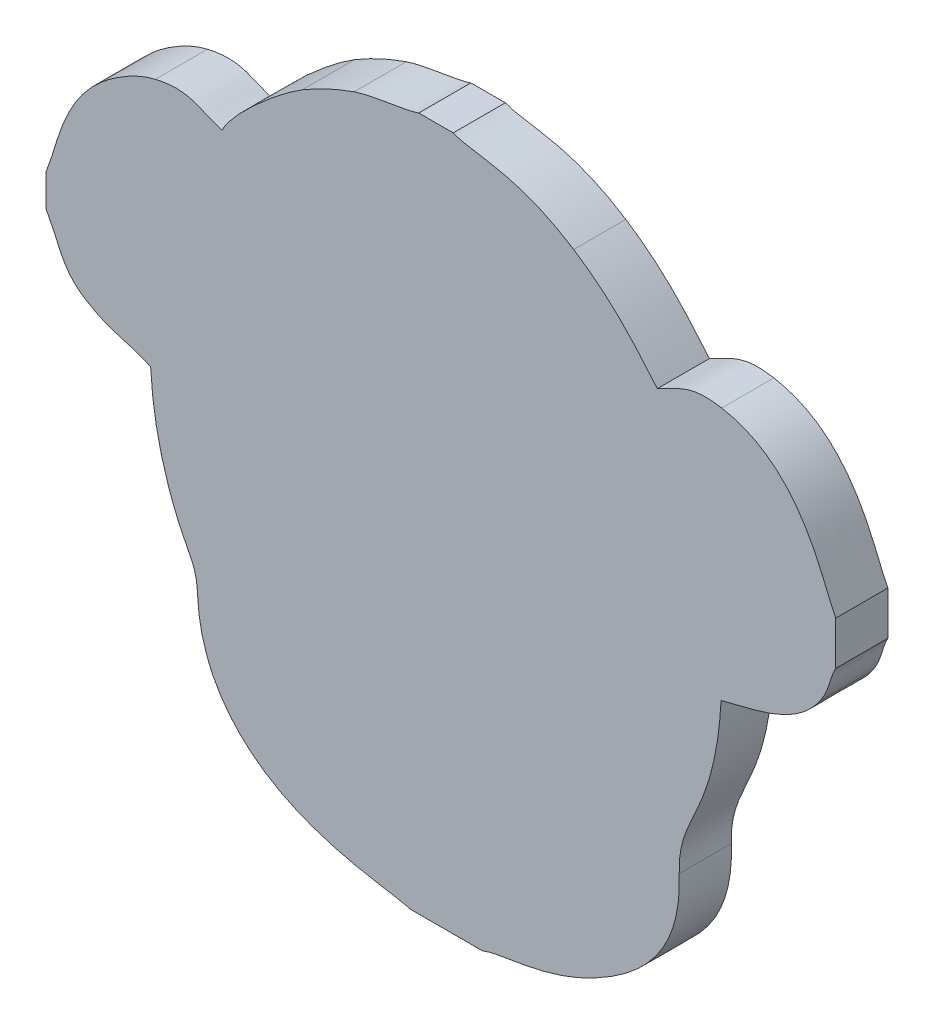
ISO-10303-21;
HEADER;
FILE_DESCRIPTION(('STEP AP214'),'2;1');
FILE_NAME('part.step','',(''),(''),'','','');
FILE_SCHEMA(('AUTOMOTIVE_DESIGN { 1 0 10303 214 1 1 1 1 }'));
ENDSEC;
DATA;
#1=APPLICATION_CONTEXT('core data for automotive mechanical design processes');
#2=APPLICATION_PROTOCOL_DEFINITION('international standard','automotive_design',2000,#1);
#3=PRODUCT_CONTEXT('',#1,'mechanical');
#4=PRODUCT('Part','Part','',(#3));
#5=PRODUCT_RELATED_PRODUCT_CATEGORY('part','',(#4));
#6=PRODUCT_DEFINITION_FORMATION('','',#4);
#7=PRODUCT_DEFINITION_CONTEXT('part definition',#1,'design');
#8=PRODUCT_DEFINITION('design','',#6,#7);
#9=PRODUCT_DEFINITION_SHAPE('','',#8);
#10=(LENGTH_UNIT() NAMED_UNIT(*) SI_UNIT(.MILLI.,.METRE.));
#11=(NAMED_UNIT(*) PLANE_ANGLE_UNIT() SI_UNIT($,.RADIAN.));
#12=(NAMED_UNIT(*) SI_UNIT($,.STERADIAN.) SOLID_ANGLE_UNIT());
#13=UNCERTAINTY_MEASURE_WITH_UNIT(LENGTH_MEASURE(1.E-05),#10,'distance_accuracy_value','');
#14=(GEOMETRIC_REPRESENTATION_CONTEXT(3) GLOBAL_UNCERTAINTY_ASSIGNED_CONTEXT((#13)) GLOBAL_UNIT_ASSIGNED_CONTEXT((#10,
#11,#12)) REPRESENTATION_CONTEXT('',''));
#15=CARTESIAN_POINT('',(0.,0.,0.));
#16=DIRECTION('',(0.,0.,1.));
#17=DIRECTION('',(1.,0.,0.));
#18=AXIS2_PLACEMENT_3D('',#15,#16,#17);
#19=CARTESIAN_POINT('',(55.1272,103.3338,3.));
#20=CARTESIAN_POINT('',(55.9357,101.875,3.));
#21=CARTESIAN_POINT('',(56.0272,100.8916,3.));
#22=CARTESIAN_POINT('',(57.2517,100.0613,3.));
#23=B_SPLINE_CURVE_WITH_KNOTS('',3,(#19,#20,#21,#22),.UNSPECIFIED.,.F.,.F.,(4,4),
(0.0384615384615385,0.0769230769230769),.UNSPECIFIED.);
#24=DIRECTION('',(0.,0.,-1.));
#25=VECTOR('',#24,1.);
#26=SURFACE_OF_LINEAR_EXTRUSION('',#23,#25);
#27=CARTESIAN_POINT('',(55.1272,103.3338,0.));
#28=CARTESIAN_POINT('',(55.9357,101.875,0.));
#29=CARTESIAN_POINT('',(56.0272,100.8916,0.));
#30=CARTESIAN_POINT('',(57.2517,100.0613,0.));
#31=B_SPLINE_CURVE_WITH_KNOTS('',3,(#27,#28,#29,#30),.UNSPECIFIED.,.F.,.F.,(4,4),
(0.0384615384615385,0.0769230769230769),.UNSPECIFIED.);
#32=CARTESIAN_POINT('',(55.1272,103.3338,0.));
#33=VERTEX_POINT('',#32);
#34=CARTESIAN_POINT('',(57.2517,100.0613,0.));
#35=VERTEX_POINT('',#34);
#36=EDGE_CURVE('E412',#33,#35,#31,.T.);
#37=ORIENTED_EDGE('',*,*,#36,.T.);
#38=DIRECTION('',(0.,0.,-1.));
#39=VECTOR('',#38,1.);
#40=CARTESIAN_POINT('',(57.2517,100.0613,3.));
#41=LINE('',#40,#39);
#42=CARTESIAN_POINT('',(57.2517,100.0613,3.));
#43=VERTEX_POINT('',#42);
#44=EDGE_CURVE('E11',#43,#35,#41,.T.);
#45=ORIENTED_EDGE('',*,*,#44,.F.);
#46=CARTESIAN_POINT('',(55.1272,103.3338,3.));
#47=VERTEX_POINT('',#46);
#48=EDGE_CURVE('E546',#47,#43,#23,.T.);
#49=ORIENTED_EDGE('',*,*,#48,.F.);
#50=DIRECTION('',(0.,0.,-1.));
#51=VECTOR('',#50,1.);
#52=CARTESIAN_POINT('',(55.1272,103.3338,3.));
#53=LINE('',#52,#51);
#54=EDGE_CURVE('E230',#47,#33,#53,.T.);
#55=ORIENTED_EDGE('',*,*,#54,.T.);
#56=EDGE_LOOP('',(#37,#45,#49,#55));
#57=FACE_BOUND('',#56,.T.);
#58=ADVANCED_FACE('F35',(#57),#26,.F.);
#59=CARTESIAN_POINT('',(57.2517,100.0613,3.));
#60=CARTESIAN_POINT('',(58.7272,99.0608,3.));
#61=CARTESIAN_POINT('',(59.7559,99.1354,3.));
#62=CARTESIAN_POINT('',(61.1406,98.4843,3.));
#63=B_SPLINE_CURVE_WITH_KNOTS('',3,(#59,#60,#61,#62),.UNSPECIFIED.,.F.,.F.,(4,4),
(0.0769230769230769,0.115384615384615),.UNSPECIFIED.);
#64=DIRECTION('',(0.,0.,-1.));
#65=VECTOR('',#64,1.);
#66=SURFACE_OF_LINEAR_EXTRUSION('',#63,#65);
#67=CARTESIAN_POINT('',(57.2517,100.0613,0.));
#68=CARTESIAN_POINT('',(58.7272,99.0608,0.));
#69=CARTESIAN_POINT('',(59.7559,99.1354,0.));
#70=CARTESIAN_POINT('',(61.1406,98.4843,0.));
#71=B_SPLINE_CURVE_WITH_KNOTS('',3,(#67,#68,#69,#70),.UNSPECIFIED.,.F.,.F.,(4,4),
(0.0769230769230769,0.115384615384615),.UNSPECIFIED.);
#72=CARTESIAN_POINT('',(61.1406,98.4843,0.));
#73=VERTEX_POINT('',#72);
#74=EDGE_CURVE('E406',#35,#73,#71,.T.);
#75=ORIENTED_EDGE('',*,*,#74,.T.);
#76=DIRECTION('',(0.,0.,-1.));
#77=VECTOR('',#76,1.);
#78=CARTESIAN_POINT('',(61.1406,98.4843,3.));
#79=LINE('',#78,#77);
#80=CARTESIAN_POINT('',(61.1406,98.4843,3.));
#81=VERTEX_POINT('',#80);
#82=EDGE_CURVE('E44',#81,#73,#79,.T.);
#83=ORIENTED_EDGE('',*,*,#82,.F.);
#84=EDGE_CURVE('E146',#43,#81,#63,.T.);
#85=ORIENTED_EDGE('',*,*,#84,.F.);
#86=ORIENTED_EDGE('',*,*,#44,.T.);
#87=EDGE_LOOP('',(#75,#83,#85,#86));
#88=FACE_BOUND('',#87,.T.);
#89=ADVANCED_FACE('F574',(#88),#66,.F.);
#90=CARTESIAN_POINT('',(61.1406,98.4843,3.));
#91=CARTESIAN_POINT('',(61.2643,95.9602,3.));
#92=CARTESIAN_POINT('',(61.838,93.6047,3.));
#93=CARTESIAN_POINT('',(62.7653,91.5083,3.));
#94=B_SPLINE_CURVE_WITH_KNOTS('',3,(#90,#91,#92,#93),.UNSPECIFIED.,.F.,.F.,(4,4),
(0.115384615384615,0.153846153846154),.UNSPECIFIED.);
#95=DIRECTION('',(0.,0.,-1.));
#96=VECTOR('',#95,1.);
#97=SURFACE_OF_LINEAR_EXTRUSION('',#94,#96);
#98=CARTESIAN_POINT('',(61.1406,98.4843,0.));
#99=CARTESIAN_POINT('',(61.2643,95.9602,0.));
#100=CARTESIAN_POINT('',(61.838,93.6047,0.));
#101=CARTESIAN_POINT('',(62.7653,91.5083,0.));
#102=B_SPLINE_CURVE_WITH_KNOTS('',3,(#98,#99,#100,#101),.UNSPECIFIED.,.F.,.F.,(4,4),
(0.115384615384615,0.153846153846154),.UNSPECIFIED.);
#103=CARTESIAN_POINT('',(62.7653,91.5083,0.));
#104=VERTEX_POINT('',#103);
#105=EDGE_CURVE('E400',#73,#104,#102,.T.);
#106=ORIENTED_EDGE('',*,*,#105,.T.);
#107=DIRECTION('',(0.,0.,-1.));
#108=VECTOR('',#107,1.);
#109=CARTESIAN_POINT('',(62.7653,91.5083,3.));
#110=LINE('',#109,#108);
#111=CARTESIAN_POINT('',(62.7653,91.5083,3.));
#112=VERTEX_POINT('',#111);
#113=EDGE_CURVE('E392',#112,#104,#110,.T.);
#114=ORIENTED_EDGE('',*,*,#113,.F.);
#115=EDGE_CURVE('E401',#81,#112,#94,.T.);
#116=ORIENTED_EDGE('',*,*,#115,.F.);
#117=ORIENTED_EDGE('',*,*,#82,.T.);
#118=EDGE_LOOP('',(#106,#114,#116,#117));
#119=FACE_BOUND('',#118,.T.);
#120=ADVANCED_FACE('F398',(#119),#97,.F.);
#121=CARTESIAN_POINT('',(62.7653,91.5083,3.));
#122=CARTESIAN_POINT('',(63.3171,90.261,3.));
#123=CARTESIAN_POINT('',(63.7888,89.9265,3.));
#124=CARTESIAN_POINT('',(63.8434,88.4315,3.));
#125=B_SPLINE_CURVE_WITH_KNOTS('',3,(#121,#122,#123,#124),.UNSPECIFIED.,.F.,.F.,(4,4),
(0.153846153846154,0.192307692307692),.UNSPECIFIED.);
#126=DIRECTION('',(0.,0.,-1.));
#127=VECTOR('',#126,1.);
#128=SURFACE_OF_LINEAR_EXTRUSION('',#125,#127);
#129=CARTESIAN_POINT('',(62.7653,91.5083,0.));
#130=CARTESIAN_POINT('',(63.3171,90.261,0.));
#131=CARTESIAN_POINT('',(63.7888,89.9265,0.));
#132=CARTESIAN_POINT('',(63.8434,88.4315,0.));
#133=B_SPLINE_CURVE_WITH_KNOTS('',3,(#129,#130,#131,#132),.UNSPECIFIED.,.F.,.F.,(4,4),
(0.153846153846154,0.192307692307692),.UNSPECIFIED.);
#134=CARTESIAN_POINT('',(63.8434,88.4315,0.));
#135=VERTEX_POINT('',#134);
#136=EDGE_CURVE('E408',#104,#135,#133,.T.);
#137=ORIENTED_EDGE('',*,*,#136,.T.);
#138=DIRECTION('',(0.,0.,-1.));
#139=VECTOR('',#138,1.);
#140=CARTESIAN_POINT('',(63.8434,88.4315,3.));
#141=LINE('',#140,#139);
#142=CARTESIAN_POINT('',(63.8434,88.4315,3.));
#143=VERTEX_POINT('',#142);
#144=EDGE_CURVE('E389',#143,#135,#141,.T.);
#145=ORIENTED_EDGE('',*,*,#144,.F.);
#146=EDGE_CURVE('E586',#112,#143,#125,.T.);
#147=ORIENTED_EDGE('',*,*,#146,.F.);
#148=ORIENTED_EDGE('',*,*,#113,.T.);
#149=EDGE_LOOP('',(#137,#145,#147,#148));
#150=FACE_BOUND('',#149,.T.);
#151=ADVANCED_FACE('F579',(#150),#128,.F.);
#152=CARTESIAN_POINT('',(63.8434,88.4315,3.));
#153=CARTESIAN_POINT('',(63.8899,87.1583,3.));
#154=CARTESIAN_POINT('',(64.224,85.8877,3.));
#155=CARTESIAN_POINT('',(64.7219,84.8986,3.));
#156=B_SPLINE_CURVE_WITH_KNOTS('',3,(#152,#153,#154,#155),.UNSPECIFIED.,.F.,.F.,(4,4),
(0.192307692307692,0.230769230769231),.UNSPECIFIED.);
#157=DIRECTION('',(0.,0.,-1.));
#158=VECTOR('',#157,1.);
#159=SURFACE_OF_LINEAR_EXTRUSION('',#156,#158);
#160=CARTESIAN_POINT('',(63.8434,88.4315,0.));
#161=CARTESIAN_POINT('',(63.8899,87.1583,0.));
#162=CARTESIAN_POINT('',(64.224,85.8877,0.));
#163=CARTESIAN_POINT('',(64.7219,84.8986,0.));
#164=B_SPLINE_CURVE_WITH_KNOTS('',3,(#160,#161,#162,#163),.UNSPECIFIED.,.F.,.F.,(4,4),
(0.192307692307692,0.230769230769231),.UNSPECIFIED.);
#165=CARTESIAN_POINT('',(64.7219,84.8986,0.));
#166=VERTEX_POINT('',#165);
#167=EDGE_CURVE('E410',#135,#166,#164,.T.);
#168=ORIENTED_EDGE('',*,*,#167,.T.);
#169=DIRECTION('',(0.,0.,-1.));
#170=VECTOR('',#169,1.);
#171=CARTESIAN_POINT('',(64.7219,84.8986,3.));
#172=LINE('',#171,#170);
#173=CARTESIAN_POINT('',(64.7219,84.8986,3.));
#174=VERTEX_POINT('',#173);
#175=EDGE_CURVE('E386',#174,#166,#172,.T.);
#176=ORIENTED_EDGE('',*,*,#175,.F.);
#177=EDGE_CURVE('E590',#143,#174,#156,.T.);
#178=ORIENTED_EDGE('',*,*,#177,.F.);
#179=ORIENTED_EDGE('',*,*,#144,.T.);
#180=EDGE_LOOP('',(#168,#176,#178,#179));
#181=FACE_BOUND('',#180,.T.);
#182=ADVANCED_FACE('F582',(#181),#159,.F.);
#183=CARTESIAN_POINT('',(64.7219,84.8986,3.));
#184=CARTESIAN_POINT('',(67.4566,79.4661,3.));
#185=CARTESIAN_POINT('',(74.7931,79.4131,3.));
#186=CARTESIAN_POINT('',(76.0211,78.9235,3.));
#187=B_SPLINE_CURVE_WITH_KNOTS('',3,(#183,#184,#185,#186),.UNSPECIFIED.,.F.,.F.,(4,4),
(0.230769230769231,0.269230769230769),.UNSPECIFIED.);
#188=DIRECTION('',(0.,0.,-1.));
#189=VECTOR('',#188,1.);
#190=SURFACE_OF_LINEAR_EXTRUSION('',#187,#189);
#191=CARTESIAN_POINT('',(64.7219,84.8986,0.));
#192=CARTESIAN_POINT('',(67.4566,79.4661,0.));
#193=CARTESIAN_POINT('',(74.7931,79.4131,0.));
#194=CARTESIAN_POINT('',(76.0211,78.9235,0.));
#195=B_SPLINE_CURVE_WITH_KNOTS('',3,(#191,#192,#193,#194),.UNSPECIFIED.,.F.,.F.,(4,4),
(0.230769230769231,0.269230769230769),.UNSPECIFIED.);
#196=CARTESIAN_POINT('',(76.0211,78.9235,0.));
#197=VERTEX_POINT('',#196);
#198=EDGE_CURVE('E430',#166,#197,#195,.T.);
#199=ORIENTED_EDGE('',*,*,#198,.T.);
#200=DIRECTION('',(0.,0.,-1.));
#201=VECTOR('',#200,1.);
#202=CARTESIAN_POINT('',(76.0211,78.9235,3.));
#203=LINE('',#202,#201);
#204=CARTESIAN_POINT('',(76.0211,78.9235,3.));
#205=VERTEX_POINT('',#204);
#206=EDGE_CURVE('E383',#205,#197,#203,.T.);
#207=ORIENTED_EDGE('',*,*,#206,.F.);
#208=EDGE_CURVE('E598',#174,#205,#187,.T.);
#209=ORIENTED_EDGE('',*,*,#208,.F.);
#210=ORIENTED_EDGE('',*,*,#175,.T.);
#211=EDGE_LOOP('',(#199,#207,#209,#210));
#212=FACE_BOUND('',#211,.T.);
#213=ADVANCED_FACE('F611',(#212),#190,.F.);
#214=CARTESIAN_POINT('',(76.0211,78.9235,3.));
#215=DIRECTION('',(0.,1.,0.));
#216=DIRECTION('',(0.,0.,1.));
#217=AXIS2_PLACEMENT_3D('',#214,#215,#216);
#218=PLANE('',#217);
#219=DIRECTION('',(1.,0.,0.));
#220=VECTOR('',#219,1.);
#221=CARTESIAN_POINT('',(76.0211,78.9235,0.));
#222=LINE('',#221,#220);
#223=CARTESIAN_POINT('',(80.2468,78.9235,0.));
#224=VERTEX_POINT('',#223);
#225=EDGE_CURVE('E437',#197,#224,#222,.T.);
#226=ORIENTED_EDGE('',*,*,#225,.T.);
#227=DIRECTION('',(0.,0.,-1.));
#228=VECTOR('',#227,1.);
#229=CARTESIAN_POINT('',(80.2468,78.9235,3.));
#230=LINE('',#229,#228);
#231=CARTESIAN_POINT('',(80.2468,78.9235,3.));
#232=VERTEX_POINT('',#231);
#233=EDGE_CURVE('E380',#232,#224,#230,.T.);
#234=ORIENTED_EDGE('',*,*,#233,.F.);
#235=DIRECTION('',(1.,0.,0.));
#236=VECTOR('',#235,1.);
#237=CARTESIAN_POINT('',(76.0211,78.9235,3.));
#238=LINE('',#237,#236);
#239=EDGE_CURVE('E606',#205,#232,#238,.T.);
#240=ORIENTED_EDGE('',*,*,#239,.F.);
#241=ORIENTED_EDGE('',*,*,#206,.T.);
#242=EDGE_LOOP('',(#226,#234,#240,#241));
#243=FACE_BOUND('',#242,.T.);
#244=ADVANCED_FACE('F614',(#243),#218,.F.);
#245=CARTESIAN_POINT('',(80.2468,78.9235,3.));
#246=CARTESIAN_POINT('',(81.4396,79.4171,3.));
#247=CARTESIAN_POINT('',(83.7679,79.2274,3.));
#248=CARTESIAN_POINT('',(86.7105,80.8069,3.));
#249=B_SPLINE_CURVE_WITH_KNOTS('',3,(#245,#246,#247,#248),.UNSPECIFIED.,.F.,.F.,(4,4),
(0.307692307692308,0.346153846153846),.UNSPECIFIED.);
#250=DIRECTION('',(0.,0.,-1.));
#251=VECTOR('',#250,1.);
#252=SURFACE_OF_LINEAR_EXTRUSION('',#249,#251);
#253=CARTESIAN_POINT('',(80.2468,78.9235,0.));
#254=CARTESIAN_POINT('',(81.4396,79.4171,0.));
#255=CARTESIAN_POINT('',(83.7679,79.2274,0.));
#256=CARTESIAN_POINT('',(86.7105,80.8069,0.));
#257=B_SPLINE_CURVE_WITH_KNOTS('',3,(#253,#254,#255,#256),.UNSPECIFIED.,.F.,.F.,(4,4),
(0.307692307692308,0.346153846153846),.UNSPECIFIED.);
#258=CARTESIAN_POINT('',(86.7105,80.8069,0.));
#259=VERTEX_POINT('',#258);
#260=EDGE_CURVE('E442',#224,#259,#257,.T.);
#261=ORIENTED_EDGE('',*,*,#260,.T.);
#262=DIRECTION('',(0.,0.,-1.));
#263=VECTOR('',#262,1.);
#264=CARTESIAN_POINT('',(86.7105,80.8069,3.));
#265=LINE('',#264,#263);
#266=CARTESIAN_POINT('',(86.7105,80.8069,3.));
#267=VERTEX_POINT('',#266);
#268=EDGE_CURVE('E377',#267,#259,#265,.T.);
#269=ORIENTED_EDGE('',*,*,#268,.F.);
#270=EDGE_CURVE('E626',#232,#267,#249,.T.);
#271=ORIENTED_EDGE('',*,*,#270,.F.);
#272=ORIENTED_EDGE('',*,*,#233,.T.);
#273=EDGE_LOOP('',(#261,#269,#271,#272));
#274=FACE_BOUND('',#273,.T.);
#275=ADVANCED_FACE('F618',(#274),#252,.F.);
#276=CARTESIAN_POINT('',(86.7105,80.8069,3.));
#277=CARTESIAN_POINT('',(89.8776,82.5068,3.));
#278=CARTESIAN_POINT('',(91.6976,84.7693,3.));
#279=CARTESIAN_POINT('',(91.5598,88.4331,3.));
#280=B_SPLINE_CURVE_WITH_KNOTS('',3,(#276,#277,#278,#279),.UNSPECIFIED.,.F.,.F.,(4,4),
(0.346153846153846,0.384615384615385),.UNSPECIFIED.);
#281=DIRECTION('',(0.,0.,-1.));
#282=VECTOR('',#281,1.);
#283=SURFACE_OF_LINEAR_EXTRUSION('',#280,#282);
#284=CARTESIAN_POINT('',(86.7105,80.8069,0.));
#285=CARTESIAN_POINT('',(89.8776,82.5068,0.));
#286=CARTESIAN_POINT('',(91.6976,84.7693,0.));
#287=CARTESIAN_POINT('',(91.5598,88.4331,0.));
#288=B_SPLINE_CURVE_WITH_KNOTS('',3,(#284,#285,#286,#287),.UNSPECIFIED.,.F.,.F.,(4,4),
(0.346153846153846,0.384615384615385),.UNSPECIFIED.);
#289=CARTESIAN_POINT('',(91.5598,88.4331,0.));
#290=VERTEX_POINT('',#289);
#291=EDGE_CURVE('E446',#259,#290,#288,.T.);
#292=ORIENTED_EDGE('',*,*,#291,.T.);
#293=DIRECTION('',(0.,0.,-1.));
#294=VECTOR('',#293,1.);
#295=CARTESIAN_POINT('',(91.5598,88.4331,3.));
#296=LINE('',#295,#294);
#297=CARTESIAN_POINT('',(91.5598,88.4331,3.));
#298=VERTEX_POINT('',#297);
#299=EDGE_CURVE('E374',#298,#290,#296,.T.);
#300=ORIENTED_EDGE('',*,*,#299,.F.);
#301=EDGE_CURVE('E630',#267,#298,#280,.T.);
#302=ORIENTED_EDGE('',*,*,#301,.F.);
#303=ORIENTED_EDGE('',*,*,#268,.T.);
#304=EDGE_LOOP('',(#292,#300,#302,#303));
#305=FACE_BOUND('',#304,.T.);
#306=ADVANCED_FACE('F622',(#305),#283,.F.);
#307=CARTESIAN_POINT('',(91.5598,88.4331,3.));
#308=CARTESIAN_POINT('',(91.4432,91.536,3.));
#309=CARTESIAN_POINT('',(93.6274,92.0439,3.));
#310=CARTESIAN_POINT('',(93.9689,98.2668,3.));
#311=B_SPLINE_CURVE_WITH_KNOTS('',3,(#307,#308,#309,#310),.UNSPECIFIED.,.F.,.F.,(4,4),
(0.384615384615385,0.423076923076923),.UNSPECIFIED.);
#312=DIRECTION('',(0.,0.,-1.));
#313=VECTOR('',#312,1.);
#314=SURFACE_OF_LINEAR_EXTRUSION('',#311,#313);
#315=CARTESIAN_POINT('',(91.5598,88.4331,0.));
#316=CARTESIAN_POINT('',(91.4432,91.536,0.));
#317=CARTESIAN_POINT('',(93.6274,92.0439,0.));
#318=CARTESIAN_POINT('',(93.9689,98.2668,0.));
#319=B_SPLINE_CURVE_WITH_KNOTS('',3,(#315,#316,#317,#318),.UNSPECIFIED.,.F.,.F.,(4,4),
(0.384615384615385,0.423076923076923),.UNSPECIFIED.);
#320=CARTESIAN_POINT('',(93.9689,98.2668,0.));
#321=VERTEX_POINT('',#320);
#322=EDGE_CURVE('E453',#290,#321,#319,.T.);
#323=ORIENTED_EDGE('',*,*,#322,.T.);
#324=DIRECTION('',(0.,0.,-1.));
#325=VECTOR('',#324,1.);
#326=CARTESIAN_POINT('',(93.9689,98.2668,3.));
#327=LINE('',#326,#325);
#328=CARTESIAN_POINT('',(93.9689,98.2668,3.));
#329=VERTEX_POINT('',#328);
#330=EDGE_CURVE('E371',#329,#321,#327,.T.);
#331=ORIENTED_EDGE('',*,*,#330,.F.);
#332=EDGE_CURVE('E638',#298,#329,#311,.T.);
#333=ORIENTED_EDGE('',*,*,#332,.F.);
#334=ORIENTED_EDGE('',*,*,#299,.T.);
#335=EDGE_LOOP('',(#323,#331,#333,#334));
#336=FACE_BOUND('',#335,.T.);
#337=ADVANCED_FACE('F654',(#336),#314,.F.);
#338=CARTESIAN_POINT('',(93.9689,98.2668,3.));
#339=CARTESIAN_POINT('',(96.0863,98.8396,3.));
#340=CARTESIAN_POINT('',(98.2608,99.0994,3.));
#341=CARTESIAN_POINT('',(99.6714,101.1074,3.));
#342=B_SPLINE_CURVE_WITH_KNOTS('',3,(#338,#339,#340,#341),.UNSPECIFIED.,.F.,.F.,(4,4),
(0.423076923076923,0.461538461538462),.UNSPECIFIED.);
#343=DIRECTION('',(0.,0.,-1.));
#344=VECTOR('',#343,1.);
#345=SURFACE_OF_LINEAR_EXTRUSION('',#342,#344);
#346=CARTESIAN_POINT('',(93.9689,98.2668,0.));
#347=CARTESIAN_POINT('',(96.0863,98.8396,0.));
#348=CARTESIAN_POINT('',(98.2608,99.0994,0.));
#349=CARTESIAN_POINT('',(99.6714,101.1074,0.));
#350=B_SPLINE_CURVE_WITH_KNOTS('',3,(#346,#347,#348,#349),.UNSPECIFIED.,.F.,.F.,(4,4),
(0.423076923076923,0.461538461538462),.UNSPECIFIED.);
#351=CARTESIAN_POINT('',(99.6714,101.1074,0.));
#352=VERTEX_POINT('',#351);
#353=EDGE_CURVE('E460',#321,#352,#350,.T.);
#354=ORIENTED_EDGE('',*,*,#353,.T.);
#355=DIRECTION('',(0.,0.,-1.));
#356=VECTOR('',#355,1.);
#357=CARTESIAN_POINT('',(99.6714,101.1074,3.));
#358=LINE('',#357,#356);
#359=CARTESIAN_POINT('',(99.6714,101.1074,3.));
#360=VERTEX_POINT('',#359);
#361=EDGE_CURVE('E368',#360,#352,#358,.T.);
#362=ORIENTED_EDGE('',*,*,#361,.F.);
#363=EDGE_CURVE('E646',#329,#360,#342,.T.);
#364=ORIENTED_EDGE('',*,*,#363,.F.);
#365=ORIENTED_EDGE('',*,*,#330,.T.);
#366=EDGE_LOOP('',(#354,#362,#364,#365));
#367=FACE_BOUND('',#366,.T.);
#368=ADVANCED_FACE('F657',(#367),#345,.F.);
#369=CARTESIAN_POINT('',(99.6714,101.1074,3.));
#370=CARTESIAN_POINT('',(100.2485,101.9289,3.));
#371=CARTESIAN_POINT('',(100.1784,102.4641,3.));
#372=CARTESIAN_POINT('',(100.5659,103.1647,3.));
#373=B_SPLINE_CURVE_WITH_KNOTS('',3,(#369,#370,#371,#372),.UNSPECIFIED.,.F.,.F.,(4,4),
(0.461538461538462,0.5),.UNSPECIFIED.);
#374=DIRECTION('',(0.,0.,-1.));
#375=VECTOR('',#374,1.);
#376=SURFACE_OF_LINEAR_EXTRUSION('',#373,#375);
#377=CARTESIAN_POINT('',(99.6714,101.1074,0.));
#378=CARTESIAN_POINT('',(100.2485,101.9289,0.));
#379=CARTESIAN_POINT('',(100.1784,102.4641,0.));
#380=CARTESIAN_POINT('',(100.5659,103.1647,0.));
#381=B_SPLINE_CURVE_WITH_KNOTS('',3,(#377,#378,#379,#380),.UNSPECIFIED.,.F.,.F.,(4,4),
(0.461538461538462,0.5),.UNSPECIFIED.);
#382=CARTESIAN_POINT('',(100.5659,103.1647,0.));
#383=VERTEX_POINT('',#382);
#384=EDGE_CURVE('E467',#352,#383,#381,.T.);
#385=ORIENTED_EDGE('',*,*,#384,.T.);
#386=DIRECTION('',(0.,0.,-1.));
#387=VECTOR('',#386,1.);
#388=CARTESIAN_POINT('',(100.5659,103.1647,3.));
#389=LINE('',#388,#387);
#390=CARTESIAN_POINT('',(100.5659,103.1647,3.));
#391=VERTEX_POINT('',#390);
#392=EDGE_CURVE('E365',#391,#383,#389,.T.);
#393=ORIENTED_EDGE('',*,*,#392,.F.);
#394=EDGE_CURVE('E668',#360,#391,#373,.T.);
#395=ORIENTED_EDGE('',*,*,#394,.F.);
#396=ORIENTED_EDGE('',*,*,#361,.T.);
#397=EDGE_LOOP('',(#385,#393,#395,#396));
#398=FACE_BOUND('',#397,.T.);
#399=ADVANCED_FACE('F661',(#398),#376,.F.);
#400=CARTESIAN_POINT('',(100.5659,103.1647,3.));
#401=DIRECTION('',(-1.,0.,0.));
#402=DIRECTION('',(0.,0.,1.));
#403=AXIS2_PLACEMENT_3D('',#400,#401,#402);
#404=PLANE('',#403);
#405=DIRECTION('',(0.,1.,0.));
#406=VECTOR('',#405,1.);
#407=CARTESIAN_POINT('',(100.5659,103.1647,0.));
#408=LINE('',#407,#406);
#409=CARTESIAN_POINT('',(100.5659,105.6703,0.));
#410=VERTEX_POINT('',#409);
#411=EDGE_CURVE('E474',#383,#410,#408,.T.);
#412=ORIENTED_EDGE('',*,*,#411,.T.);
#413=DIRECTION('',(0.,0.,-1.));
#414=VECTOR('',#413,1.);
#415=CARTESIAN_POINT('',(100.5659,105.6703,3.));
#416=LINE('',#415,#414);
#417=CARTESIAN_POINT('',(100.5659,105.6703,3.));
#418=VERTEX_POINT('',#417);
#419=EDGE_CURVE('E362',#418,#410,#416,.T.);
#420=ORIENTED_EDGE('',*,*,#419,.F.);
#421=DIRECTION('',(0.,1.,0.));
#422=VECTOR('',#421,1.);
#423=CARTESIAN_POINT('',(100.5659,103.1647,3.));
#424=LINE('',#423,#422);
#425=EDGE_CURVE('E673',#391,#418,#424,.T.);
#426=ORIENTED_EDGE('',*,*,#425,.F.);
#427=ORIENTED_EDGE('',*,*,#392,.T.);
#428=EDGE_LOOP('',(#412,#420,#426,#427));
#429=FACE_BOUND('',#428,.T.);
#430=ADVANCED_FACE('F665',(#429),#404,.F.);
#431=CARTESIAN_POINT('',(100.5659,105.6703,3.));
#432=CARTESIAN_POINT('',(99.7223,107.2591,3.));
#433=CARTESIAN_POINT('',(98.5859,112.0519,3.));
#434=CARTESIAN_POINT('',(94.0061,112.8642,3.));
#435=B_SPLINE_CURVE_WITH_KNOTS('',3,(#431,#432,#433,#434),.UNSPECIFIED.,.F.,.F.,(4,4),
(0.538461538461538,0.576923076923077),.UNSPECIFIED.);
#436=DIRECTION('',(0.,0.,-1.));
#437=VECTOR('',#436,1.);
#438=SURFACE_OF_LINEAR_EXTRUSION('',#435,#437);
#439=CARTESIAN_POINT('',(100.5659,105.6703,0.));
#440=CARTESIAN_POINT('',(99.7223,107.2591,0.));
#441=CARTESIAN_POINT('',(98.5859,112.0519,0.));
#442=CARTESIAN_POINT('',(94.0061,112.8642,0.));
#443=B_SPLINE_CURVE_WITH_KNOTS('',3,(#439,#440,#441,#442),.UNSPECIFIED.,.F.,.F.,(4,4),
(0.538461538461538,0.576923076923077),.UNSPECIFIED.);
#444=CARTESIAN_POINT('',(94.0061,112.8642,0.));
#445=VERTEX_POINT('',#444);
#446=EDGE_CURVE('E479',#410,#445,#443,.T.);
#447=ORIENTED_EDGE('',*,*,#446,.T.);
#448=DIRECTION('',(0.,0.,-1.));
#449=VECTOR('',#448,1.);
#450=CARTESIAN_POINT('',(94.0061,112.8642,3.));
#451=LINE('',#450,#449);
#452=CARTESIAN_POINT('',(94.0061,112.8642,3.));
#453=VERTEX_POINT('',#452);
#454=EDGE_CURVE('E359',#453,#445,#451,.T.);
#455=ORIENTED_EDGE('',*,*,#454,.F.);
#456=EDGE_CURVE('E678',#418,#453,#435,.T.);
#457=ORIENTED_EDGE('',*,*,#456,.F.);
#458=ORIENTED_EDGE('',*,*,#419,.T.);
#459=EDGE_LOOP('',(#447,#455,#457,#458));
#460=FACE_BOUND('',#459,.T.);
#461=ADVANCED_FACE('F689',(#460),#438,.F.);
#462=CARTESIAN_POINT('',(94.0061,112.8642,3.));
#463=CARTESIAN_POINT('',(92.18,113.1882,3.));
#464=CARTESIAN_POINT('',(91.4848,112.5304,3.));
#465=CARTESIAN_POINT('',(90.2994,111.974,3.));
#466=B_SPLINE_CURVE_WITH_KNOTS('',3,(#462,#463,#464,#465),.UNSPECIFIED.,.F.,.F.,(4,4),
(0.576923076923077,0.615384615384615),.UNSPECIFIED.);
#467=DIRECTION('',(0.,0.,-1.));
#468=VECTOR('',#467,1.);
#469=SURFACE_OF_LINEAR_EXTRUSION('',#466,#468);
#470=CARTESIAN_POINT('',(94.0061,112.8642,0.));
#471=CARTESIAN_POINT('',(92.18,113.1882,0.));
#472=CARTESIAN_POINT('',(91.4848,112.5304,0.));
#473=CARTESIAN_POINT('',(90.2994,111.974,0.));
#474=B_SPLINE_CURVE_WITH_KNOTS('',3,(#470,#471,#472,#473),.UNSPECIFIED.,.F.,.F.,(4,4),
(0.576923076923077,0.615384615384615),.UNSPECIFIED.);
#475=CARTESIAN_POINT('',(90.2994,111.974,0.));
#476=VERTEX_POINT('',#475);
#477=EDGE_CURVE('E483',#445,#476,#474,.T.);
#478=ORIENTED_EDGE('',*,*,#477,.T.);
#479=DIRECTION('',(0.,0.,-1.));
#480=VECTOR('',#479,1.);
#481=CARTESIAN_POINT('',(90.2994,111.974,3.));
#482=LINE('',#481,#480);
#483=CARTESIAN_POINT('',(90.2994,111.974,3.));
#484=VERTEX_POINT('',#483);
#485=EDGE_CURVE('E356',#484,#476,#482,.T.);
#486=ORIENTED_EDGE('',*,*,#485,.F.);
#487=EDGE_CURVE('E682',#453,#484,#466,.T.);
#488=ORIENTED_EDGE('',*,*,#487,.F.);
#489=ORIENTED_EDGE('',*,*,#454,.T.);
#490=EDGE_LOOP('',(#478,#486,#488,#489));
#491=FACE_BOUND('',#490,.T.);
#492=ADVANCED_FACE('F691',(#491),#469,.F.);
#493=CARTESIAN_POINT('',(90.2994,111.974,3.));
#494=CARTESIAN_POINT('',(88.7995,113.7706,3.));
#495=CARTESIAN_POINT('',(87.5152,115.1976,3.));
#496=CARTESIAN_POINT('',(85.4874,116.5045,3.));
#497=B_SPLINE_CURVE_WITH_KNOTS('',3,(#493,#494,#495,#496),.UNSPECIFIED.,.F.,.F.,(4,4),
(0.615384615384615,0.653846153846154),.UNSPECIFIED.);
#498=DIRECTION('',(0.,0.,-1.));
#499=VECTOR('',#498,1.);
#500=SURFACE_OF_LINEAR_EXTRUSION('',#497,#499);
#501=CARTESIAN_POINT('',(90.2994,111.974,0.));
#502=CARTESIAN_POINT('',(88.7995,113.7706,0.));
#503=CARTESIAN_POINT('',(87.5152,115.1976,0.));
#504=CARTESIAN_POINT('',(85.4874,116.5045,0.));
#505=B_SPLINE_CURVE_WITH_KNOTS('',3,(#501,#502,#503,#504),.UNSPECIFIED.,.F.,.F.,(4,4),
(0.615384615384615,0.653846153846154),.UNSPECIFIED.);
#506=CARTESIAN_POINT('',(85.4874,116.5045,0.));
#507=VERTEX_POINT('',#506);
#508=EDGE_CURVE('E490',#476,#507,#505,.T.);
#509=ORIENTED_EDGE('',*,*,#508,.T.);
#510=DIRECTION('',(0.,0.,-1.));
#511=VECTOR('',#510,1.);
#512=CARTESIAN_POINT('',(85.4874,116.5045,3.));
#513=LINE('',#512,#511);
#514=CARTESIAN_POINT('',(85.4874,116.5045,3.));
#515=VERTEX_POINT('',#514);
#516=EDGE_CURVE('E353',#515,#507,#513,.T.);
#517=ORIENTED_EDGE('',*,*,#516,.F.);
#518=EDGE_CURVE('E310',#484,#515,#497,.T.);
#519=ORIENTED_EDGE('',*,*,#518,.F.);
#520=ORIENTED_EDGE('',*,*,#485,.T.);
#521=EDGE_LOOP('',(#509,#517,#519,#520));
#522=FACE_BOUND('',#521,.T.);
#523=ADVANCED_FACE('F301',(#522),#500,.F.);
#524=CARTESIAN_POINT('',(85.4874,116.5045,3.));
#525=CARTESIAN_POINT('',(82.1232,118.6728,3.));
#526=CARTESIAN_POINT('',(79.9482,118.2978,3.));
#527=CARTESIAN_POINT('',(78.5521,118.8487,3.));
#528=B_SPLINE_CURVE_WITH_KNOTS('',3,(#524,#525,#526,#527),.UNSPECIFIED.,.F.,.F.,(4,4),
(0.653846153846154,0.692307692307692),.UNSPECIFIED.);
#529=DIRECTION('',(0.,0.,-1.));
#530=VECTOR('',#529,1.);
#531=SURFACE_OF_LINEAR_EXTRUSION('',#528,#530);
#532=CARTESIAN_POINT('',(85.4874,116.5045,0.));
#533=CARTESIAN_POINT('',(82.1232,118.6728,0.));
#534=CARTESIAN_POINT('',(79.9482,118.2978,0.));
#535=CARTESIAN_POINT('',(78.5521,118.8487,0.));
#536=B_SPLINE_CURVE_WITH_KNOTS('',3,(#532,#533,#534,#535),.UNSPECIFIED.,.F.,.F.,(4,4),
(0.653846153846154,0.692307692307692),.UNSPECIFIED.);
#537=CARTESIAN_POINT('',(78.5521,118.8487,0.));
#538=VERTEX_POINT('',#537);
#539=EDGE_CURVE('E497',#507,#538,#536,.T.);
#540=ORIENTED_EDGE('',*,*,#539,.T.);
#541=DIRECTION('',(0.,0.,-1.));
#542=VECTOR('',#541,1.);
#543=CARTESIAN_POINT('',(78.5521,118.8487,3.));
#544=LINE('',#543,#542);
#545=CARTESIAN_POINT('',(78.5521,118.8487,3.));
#546=VERTEX_POINT('',#545);
#547=EDGE_CURVE('E350',#546,#538,#544,.T.);
#548=ORIENTED_EDGE('',*,*,#547,.F.);
#549=EDGE_CURVE('E305',#515,#546,#528,.T.);
#550=ORIENTED_EDGE('',*,*,#549,.F.);
#551=ORIENTED_EDGE('',*,*,#516,.T.);
#552=EDGE_LOOP('',(#540,#548,#550,#551));
#553=FACE_BOUND('',#552,.T.);
#554=ADVANCED_FACE('F296',(#553),#531,.F.);
#555=CARTESIAN_POINT('',(78.5521,118.8487,3.));
#556=DIRECTION('',(0.,-1.,0.));
#557=DIRECTION('',(0.,0.,-1.));
#558=AXIS2_PLACEMENT_3D('',#555,#556,#557);
#559=PLANE('',#558);
#560=DIRECTION('',(-1.,0.,0.));
#561=VECTOR('',#560,1.);
#562=CARTESIAN_POINT('',(78.5521,118.8487,0.));
#563=LINE('',#562,#561);
#564=CARTESIAN_POINT('',(76.5707,118.8487,0.));
#565=VERTEX_POINT('',#564);
#566=EDGE_CURVE('E504',#538,#565,#563,.T.);
#567=ORIENTED_EDGE('',*,*,#566,.T.);
#568=DIRECTION('',(0.,0.,-1.));
#569=VECTOR('',#568,1.);
#570=CARTESIAN_POINT('',(76.5707,118.8487,3.));
#571=LINE('',#570,#569);
#572=CARTESIAN_POINT('',(76.5707,118.8487,3.));
#573=VERTEX_POINT('',#572);
#574=EDGE_CURVE('E330',#573,#565,#571,.T.);
#575=ORIENTED_EDGE('',*,*,#574,.F.);
#576=DIRECTION('',(-1.,0.,0.));
#577=VECTOR('',#576,1.);
#578=CARTESIAN_POINT('',(78.5521,118.8487,3.));
#579=LINE('',#578,#577);
#580=EDGE_CURVE('E309',#546,#573,#579,.T.);
#581=ORIENTED_EDGE('',*,*,#580,.F.);
#582=ORIENTED_EDGE('',*,*,#547,.T.);
#583=EDGE_LOOP('',(#567,#575,#581,#582));
#584=FACE_BOUND('',#583,.T.);
#585=ADVANCED_FACE('F292',(#584),#559,.F.);
#586=CARTESIAN_POINT('',(76.5707,118.8487,3.));
#587=CARTESIAN_POINT('',(75.9147,118.5898,3.));
#588=CARTESIAN_POINT('',(73.949,118.4167,3.));
#589=CARTESIAN_POINT('',(72.8515,118.0451,3.));
#590=B_SPLINE_CURVE_WITH_KNOTS('',3,(#586,#587,#588,#589),.UNSPECIFIED.,.F.,.F.,(4,4),
(0.730769230769231,0.769230769230769),.UNSPECIFIED.);
#591=DIRECTION('',(0.,0.,-1.));
#592=VECTOR('',#591,1.);
#593=SURFACE_OF_LINEAR_EXTRUSION('',#590,#592);
#594=CARTESIAN_POINT('',(76.5707,118.8487,0.));
#595=CARTESIAN_POINT('',(75.9147,118.5898,0.));
#596=CARTESIAN_POINT('',(73.949,118.4167,0.));
#597=CARTESIAN_POINT('',(72.8515,118.0451,0.));
#598=B_SPLINE_CURVE_WITH_KNOTS('',3,(#594,#595,#596,#597),.UNSPECIFIED.,.F.,.F.,(4,4),
(0.730769230769231,0.769230769230769),.UNSPECIFIED.);
#599=CARTESIAN_POINT('',(72.8515,118.0451,0.));
#600=VERTEX_POINT('',#599);
#601=EDGE_CURVE('E328',#565,#600,#598,.T.);
#602=ORIENTED_EDGE('',*,*,#601,.T.);
#603=DIRECTION('',(0.,0.,-1.));
#604=VECTOR('',#603,1.);
#605=CARTESIAN_POINT('',(72.8515,118.0451,3.));
#606=LINE('',#605,#604);
#607=CARTESIAN_POINT('',(72.8515,118.0451,3.));
#608=VERTEX_POINT('',#607);
#609=EDGE_CURVE('E326',#608,#600,#606,.T.);
#610=ORIENTED_EDGE('',*,*,#609,.F.);
#611=EDGE_CURVE('E277',#573,#608,#590,.T.);
#612=ORIENTED_EDGE('',*,*,#611,.F.);
#613=ORIENTED_EDGE('',*,*,#574,.T.);
#614=EDGE_LOOP('',(#602,#610,#612,#613));
#615=FACE_BOUND('',#614,.T.);
#616=ADVANCED_FACE('F288',(#615),#593,.F.);
#617=CARTESIAN_POINT('',(72.8515,118.0451,3.));
#618=CARTESIAN_POINT('',(71.807,117.6915,3.));
#619=CARTESIAN_POINT('',(70.6758,117.1447,3.));
#620=CARTESIAN_POINT('',(69.865,116.6538,3.));
#621=B_SPLINE_CURVE_WITH_KNOTS('',3,(#617,#618,#619,#620),.UNSPECIFIED.,.F.,.F.,(4,4),
(0.769230769230769,0.807692307692308),.UNSPECIFIED.);
#622=DIRECTION('',(0.,0.,-1.));
#623=VECTOR('',#622,1.);
#624=SURFACE_OF_LINEAR_EXTRUSION('',#621,#623);
#625=CARTESIAN_POINT('',(72.8515,118.0451,0.));
#626=CARTESIAN_POINT('',(71.807,117.6915,0.));
#627=CARTESIAN_POINT('',(70.6758,117.1447,0.));
#628=CARTESIAN_POINT('',(69.865,116.6538,0.));
#629=B_SPLINE_CURVE_WITH_KNOTS('',3,(#625,#626,#627,#628),.UNSPECIFIED.,.F.,.F.,(4,4),
(0.769230769230769,0.807692307692308),.UNSPECIFIED.);
#630=CARTESIAN_POINT('',(69.865,116.6538,0.));
#631=VERTEX_POINT('',#630);
#632=EDGE_CURVE('E335',#600,#631,#629,.T.);
#633=ORIENTED_EDGE('',*,*,#632,.T.);
#634=DIRECTION('',(0.,0.,-1.));
#635=VECTOR('',#634,1.);
#636=CARTESIAN_POINT('',(69.865,116.6538,3.));
#637=LINE('',#636,#635);
#638=CARTESIAN_POINT('',(69.865,116.6538,3.));
#639=VERTEX_POINT('',#638);
#640=EDGE_CURVE('E331',#639,#631,#637,.T.);
#641=ORIENTED_EDGE('',*,*,#640,.F.);
#642=EDGE_CURVE('E269',#608,#639,#621,.T.);
#643=ORIENTED_EDGE('',*,*,#642,.F.);
#644=ORIENTED_EDGE('',*,*,#609,.T.);
#645=EDGE_LOOP('',(#633,#641,#643,#644));
#646=FACE_BOUND('',#645,.T.);
#647=ADVANCED_FACE('F285',(#646),#624,.F.);
#648=CARTESIAN_POINT('',(69.865,116.6538,3.));
#649=CARTESIAN_POINT('',(68.5207,115.84,3.));
#650=CARTESIAN_POINT('',(65.7355,113.4696,3.));
#651=CARTESIAN_POINT('',(65.2526,112.3186,3.));
#652=B_SPLINE_CURVE_WITH_KNOTS('',3,(#648,#649,#650,#651),.UNSPECIFIED.,.F.,.F.,(4,4),
(0.807692307692308,0.846153846153846),.UNSPECIFIED.);
#653=DIRECTION('',(0.,0.,-1.));
#654=VECTOR('',#653,1.);
#655=SURFACE_OF_LINEAR_EXTRUSION('',#652,#654);
#656=CARTESIAN_POINT('',(69.865,116.6538,0.));
#657=CARTESIAN_POINT('',(68.5207,115.84,0.));
#658=CARTESIAN_POINT('',(65.7355,113.4696,0.));
#659=CARTESIAN_POINT('',(65.2526,112.3186,0.));
#660=B_SPLINE_CURVE_WITH_KNOTS('',3,(#656,#657,#658,#659),.UNSPECIFIED.,.F.,.F.,(4,4),
(0.807692307692308,0.846153846153846),.UNSPECIFIED.);
#661=CARTESIAN_POINT('',(65.2526,112.3186,0.));
#662=VERTEX_POINT('',#661);
#663=EDGE_CURVE('E342',#631,#662,#660,.T.);
#664=ORIENTED_EDGE('',*,*,#663,.T.);
#665=DIRECTION('',(0.,0.,-1.));
#666=VECTOR('',#665,1.);
#667=CARTESIAN_POINT('',(65.2526,112.3186,3.));
#668=LINE('',#667,#666);
#669=CARTESIAN_POINT('',(65.2526,112.3186,3.));
#670=VERTEX_POINT('',#669);
#671=EDGE_CURVE('E338',#670,#662,#668,.T.);
#672=ORIENTED_EDGE('',*,*,#671,.F.);
#673=EDGE_CURVE('E261',#639,#670,#652,.T.);
#674=ORIENTED_EDGE('',*,*,#673,.F.);
#675=ORIENTED_EDGE('',*,*,#640,.T.);
#676=EDGE_LOOP('',(#664,#672,#674,#675));
#677=FACE_BOUND('',#676,.T.);
#678=ADVANCED_FACE('F254',(#677),#655,.F.);
#679=CARTESIAN_POINT('',(65.2526,112.3186,3.));
#680=CARTESIAN_POINT('',(63.7751,112.8048,3.));
#681=CARTESIAN_POINT('',(63.3732,113.3887,3.));
#682=CARTESIAN_POINT('',(61.4119,112.9491,3.));
#683=B_SPLINE_CURVE_WITH_KNOTS('',3,(#679,#680,#681,#682),.UNSPECIFIED.,.F.,.F.,(4,4),
(0.846153846153846,0.884615384615385),.UNSPECIFIED.);
#684=DIRECTION('',(0.,0.,-1.));
#685=VECTOR('',#684,1.);
#686=SURFACE_OF_LINEAR_EXTRUSION('',#683,#685);
#687=CARTESIAN_POINT('',(65.2526,112.3186,0.));
#688=CARTESIAN_POINT('',(63.7751,112.8048,0.));
#689=CARTESIAN_POINT('',(63.3732,113.3887,0.));
#690=CARTESIAN_POINT('',(61.4119,112.9491,0.));
#691=B_SPLINE_CURVE_WITH_KNOTS('',3,(#687,#688,#689,#690),.UNSPECIFIED.,.F.,.F.,(4,4),
(0.846153846153846,0.884615384615385),.UNSPECIFIED.);
#692=CARTESIAN_POINT('',(61.4119,112.9491,0.));
#693=VERTEX_POINT('',#692);
#694=EDGE_CURVE('E345',#662,#693,#691,.T.);
#695=ORIENTED_EDGE('',*,*,#694,.T.);
#696=DIRECTION('',(0.,0.,-1.));
#697=VECTOR('',#696,1.);
#698=CARTESIAN_POINT('',(61.4119,112.9491,3.));
#699=LINE('',#698,#697);
#700=CARTESIAN_POINT('',(61.4119,112.9491,3.));
#701=VERTEX_POINT('',#700);
#702=EDGE_CURVE('E225',#701,#693,#699,.T.);
#703=ORIENTED_EDGE('',*,*,#702,.F.);
#704=EDGE_CURVE('E216',#670,#701,#683,.T.);
#705=ORIENTED_EDGE('',*,*,#704,.F.);
#706=ORIENTED_EDGE('',*,*,#671,.T.);
#707=EDGE_LOOP('',(#695,#703,#705,#706));
#708=FACE_BOUND('',#707,.T.);
#709=ADVANCED_FACE('F251',(#708),#686,.F.);
#710=CARTESIAN_POINT('',(61.4119,112.9491,3.));
#711=CARTESIAN_POINT('',(60.2523,112.6892,3.));
#712=CARTESIAN_POINT('',(59.0201,111.8593,3.));
#713=CARTESIAN_POINT('',(58.3253,111.2712,3.));
#714=B_SPLINE_CURVE_WITH_KNOTS('',3,(#710,#711,#712,#713),.UNSPECIFIED.,.F.,.F.,(4,4),
(0.884615384615385,0.923076923076923),.UNSPECIFIED.);
#715=DIRECTION('',(0.,0.,-1.));
#716=VECTOR('',#715,1.);
#717=SURFACE_OF_LINEAR_EXTRUSION('',#714,#716);
#718=CARTESIAN_POINT('',(61.4119,112.9491,0.));
#719=CARTESIAN_POINT('',(60.2523,112.6892,0.));
#720=CARTESIAN_POINT('',(59.0201,111.8593,0.));
#721=CARTESIAN_POINT('',(58.3253,111.2712,0.));
#722=B_SPLINE_CURVE_WITH_KNOTS('',3,(#718,#719,#720,#721),.UNSPECIFIED.,.F.,.F.,(4,4),
(0.884615384615385,0.923076923076923),.UNSPECIFIED.);
#723=CARTESIAN_POINT('',(58.3253,111.2712,0.));
#724=VERTEX_POINT('',#723);
#725=EDGE_CURVE('E224',#693,#724,#722,.T.);
#726=ORIENTED_EDGE('',*,*,#725,.T.);
#727=DIRECTION('',(0.,0.,-1.));
#728=VECTOR('',#727,1.);
#729=CARTESIAN_POINT('',(58.3253,111.2712,3.));
#730=LINE('',#729,#728);
#731=CARTESIAN_POINT('',(58.3253,111.2712,3.));
#732=VERTEX_POINT('',#731);
#733=EDGE_CURVE('E221',#732,#724,#730,.T.);
#734=ORIENTED_EDGE('',*,*,#733,.F.);
#735=EDGE_CURVE('E210',#701,#732,#714,.T.);
#736=ORIENTED_EDGE('',*,*,#735,.F.);
#737=ORIENTED_EDGE('',*,*,#702,.T.);
#738=EDGE_LOOP('',(#726,#734,#736,#737));
#739=FACE_BOUND('',#738,.T.);
#740=ADVANCED_FACE('F222',(#739),#717,.F.);
#741=CARTESIAN_POINT('',(58.3253,111.2712,3.));
#742=CARTESIAN_POINT('',(56.0021,109.3047,3.));
#743=CARTESIAN_POINT('',(55.7198,106.5647,3.));
#744=CARTESIAN_POINT('',(55.1272,105.2165,3.));
#745=B_SPLINE_CURVE_WITH_KNOTS('',3,(#741,#742,#743,#744),.UNSPECIFIED.,.F.,.F.,(4,4),
(0.923076923076923,1.),.UNSPECIFIED.);
#746=DIRECTION('',(0.,0.,-1.));
#747=VECTOR('',#746,1.);
#748=SURFACE_OF_LINEAR_EXTRUSION('',#745,#747);
#749=CARTESIAN_POINT('',(58.3253,111.2712,0.));
#750=CARTESIAN_POINT('',(56.0021,109.3047,0.));
#751=CARTESIAN_POINT('',(55.7198,106.5647,0.));
#752=CARTESIAN_POINT('',(55.1272,105.2165,0.));
#753=B_SPLINE_CURVE_WITH_KNOTS('',3,(#749,#750,#751,#752),.UNSPECIFIED.,.F.,.F.,(4,4),
(0.923076923076923,1.),.UNSPECIFIED.);
#754=CARTESIAN_POINT('',(55.1272,105.2165,0.));
#755=VERTEX_POINT('',#754);
#756=EDGE_CURVE('E132',#724,#755,#753,.T.);
#757=ORIENTED_EDGE('',*,*,#756,.T.);
#758=DIRECTION('',(0.,0.,-1.));
#759=VECTOR('',#758,1.);
#760=CARTESIAN_POINT('',(55.1272,105.2165,3.));
#761=LINE('',#760,#759);
#762=CARTESIAN_POINT('',(55.1272,105.2165,3.));
#763=VERTEX_POINT('',#762);
#764=EDGE_CURVE('E226',#763,#755,#761,.T.);
#765=ORIENTED_EDGE('',*,*,#764,.F.);
#766=EDGE_CURVE('E214',#732,#763,#745,.T.);
#767=ORIENTED_EDGE('',*,*,#766,.F.);
#768=ORIENTED_EDGE('',*,*,#733,.T.);
#769=EDGE_LOOP('',(#757,#765,#767,#768));
#770=FACE_BOUND('',#769,.T.);
#771=ADVANCED_FACE('F228',(#770),#748,.F.);
#772=CARTESIAN_POINT('',(55.1272,105.2165,3.));
#773=DIRECTION('',(1.,0.,0.));
#774=DIRECTION('',(0.,0.,-1.));
#775=AXIS2_PLACEMENT_3D('',#772,#773,#774);
#776=PLANE('',#775);
#777=DIRECTION('',(0.,-1.,0.));
#778=VECTOR('',#777,1.);
#779=CARTESIAN_POINT('',(55.1272,105.2165,0.));
#780=LINE('',#779,#778);
#781=EDGE_CURVE('E138',#755,#33,#780,.T.);
#782=ORIENTED_EDGE('',*,*,#781,.T.);
#783=ORIENTED_EDGE('',*,*,#54,.F.);
#784=DIRECTION('',(0.,-1.,0.));
#785=VECTOR('',#784,1.);
#786=CARTESIAN_POINT('',(55.1272,105.2165,3.));
#787=LINE('',#786,#785);
#788=EDGE_CURVE('E52',#763,#47,#787,.T.);
#789=ORIENTED_EDGE('',*,*,#788,.F.);
#790=ORIENTED_EDGE('',*,*,#764,.T.);
#791=EDGE_LOOP('',(#782,#783,#789,#790));
#792=FACE_BOUND('',#791,.T.);
#793=ADVANCED_FACE('F247',(#792),#776,.F.);
#794=CARTESIAN_POINT('',(56.03345,101.4618625,3.));
#795=DIRECTION('',(0.,0.,1.));
#796=DIRECTION('',(1.,0.,0.));
#797=AXIS2_PLACEMENT_3D('',#794,#795,#796);
#798=PLANE('',#797);
#799=ORIENTED_EDGE('',*,*,#48,.T.);
#800=ORIENTED_EDGE('',*,*,#84,.T.);
#801=ORIENTED_EDGE('',*,*,#115,.T.);
#802=ORIENTED_EDGE('',*,*,#146,.T.);
#803=ORIENTED_EDGE('',*,*,#177,.T.);
#804=ORIENTED_EDGE('',*,*,#208,.T.);
#805=ORIENTED_EDGE('',*,*,#239,.T.);
#806=ORIENTED_EDGE('',*,*,#270,.T.);
#807=ORIENTED_EDGE('',*,*,#301,.T.);
#808=ORIENTED_EDGE('',*,*,#332,.T.);
#809=ORIENTED_EDGE('',*,*,#363,.T.);
#810=ORIENTED_EDGE('',*,*,#394,.T.);
#811=ORIENTED_EDGE('',*,*,#425,.T.);
#812=ORIENTED_EDGE('',*,*,#456,.T.);
#813=ORIENTED_EDGE('',*,*,#487,.T.);
#814=ORIENTED_EDGE('',*,*,#518,.T.);
#815=ORIENTED_EDGE('',*,*,#549,.T.);
#816=ORIENTED_EDGE('',*,*,#580,.T.);
#817=ORIENTED_EDGE('',*,*,#611,.T.);
#818=ORIENTED_EDGE('',*,*,#642,.T.);
#819=ORIENTED_EDGE('',*,*,#673,.T.);
#820=ORIENTED_EDGE('',*,*,#704,.T.);
#821=ORIENTED_EDGE('',*,*,#735,.T.);
#822=ORIENTED_EDGE('',*,*,#766,.T.);
#823=ORIENTED_EDGE('',*,*,#788,.T.);
#824=EDGE_LOOP('',(#799,#800,#801,#802,#803,#804,#805,#806,#807,#808,#809,#810,#811,#812,#813,
#814,#815,#816,#817,#818,#819,#820,#821,#822,#823));
#825=FACE_BOUND('',#824,.T.);
#826=ADVANCED_FACE('F212',(#825),#798,.T.);
#827=CARTESIAN_POINT('',(56.03345,101.4618625,0.));
#828=DIRECTION('',(0.,0.,1.));
#829=DIRECTION('',(1.,0.,0.));
#830=AXIS2_PLACEMENT_3D('',#827,#828,#829);
#831=PLANE('',#830);
#832=ORIENTED_EDGE('',*,*,#36,.F.);
#833=ORIENTED_EDGE('',*,*,#781,.F.);
#834=ORIENTED_EDGE('',*,*,#756,.F.);
#835=ORIENTED_EDGE('',*,*,#725,.F.);
#836=ORIENTED_EDGE('',*,*,#694,.F.);
#837=ORIENTED_EDGE('',*,*,#663,.F.);
#838=ORIENTED_EDGE('',*,*,#632,.F.);
#839=ORIENTED_EDGE('',*,*,#601,.F.);
#840=ORIENTED_EDGE('',*,*,#566,.F.);
#841=ORIENTED_EDGE('',*,*,#539,.F.);
#842=ORIENTED_EDGE('',*,*,#508,.F.);
#843=ORIENTED_EDGE('',*,*,#477,.F.);
#844=ORIENTED_EDGE('',*,*,#446,.F.);
#845=ORIENTED_EDGE('',*,*,#411,.F.);
#846=ORIENTED_EDGE('',*,*,#384,.F.);
#847=ORIENTED_EDGE('',*,*,#353,.F.);
#848=ORIENTED_EDGE('',*,*,#322,.F.);
#849=ORIENTED_EDGE('',*,*,#291,.F.);
#850=ORIENTED_EDGE('',*,*,#260,.F.);
#851=ORIENTED_EDGE('',*,*,#225,.F.);
#852=ORIENTED_EDGE('',*,*,#198,.F.);
#853=ORIENTED_EDGE('',*,*,#167,.F.);
#854=ORIENTED_EDGE('',*,*,#136,.F.);
#855=ORIENTED_EDGE('',*,*,#105,.F.);
#856=ORIENTED_EDGE('',*,*,#74,.F.);
#857=EDGE_LOOP('',(#832,#833,#834,#835,#836,#837,#838,#839,#840,#841,#842,#843,#844,#845,#846,
#847,#848,#849,#850,#851,#852,#853,#854,#855,#856));
#858=FACE_BOUND('',#857,.T.);
#859=ADVANCED_FACE('F405',(#858),#831,.F.);
#860=CLOSED_SHELL('',(#58,#89,#120,#151,#182,#213,#244,#275,#306,#337,#368,#399,#430,#461,#492,
#523,#554,#585,#616,#647,#678,#709,#740,#771,#793,#826,#859));
#861=MANIFOLD_SOLID_BREP('B2',#860);
#862=ADVANCED_BREP_SHAPE_REPRESENTATION('',(#18,#861),#14);
#863=SHAPE_DEFINITION_REPRESENTATION(#9,#862);
ENDSEC;
END-ISO-10303-21;
